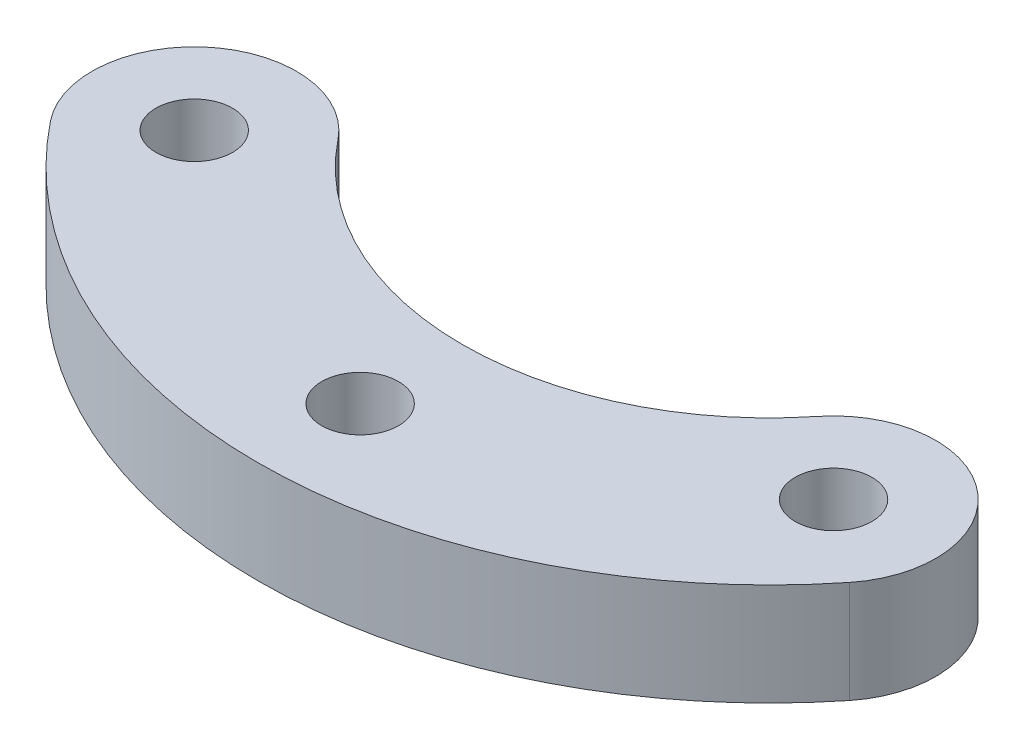
ISO-10303-21;
HEADER;
FILE_DESCRIPTION(('STEP AP214'),'2;1');
FILE_NAME('part.step','',(''),(''),'','','');
FILE_SCHEMA(('AUTOMOTIVE_DESIGN { 1 0 10303 214 1 1 1 1 }'));
ENDSEC;
DATA;
#1=APPLICATION_CONTEXT('core data for automotive mechanical design processes');
#2=APPLICATION_PROTOCOL_DEFINITION('international standard','automotive_design',2000,#1);
#3=PRODUCT_CONTEXT('',#1,'mechanical');
#4=PRODUCT('Part','Part','',(#3));
#5=PRODUCT_RELATED_PRODUCT_CATEGORY('part','',(#4));
#6=PRODUCT_DEFINITION_FORMATION('','',#4);
#7=PRODUCT_DEFINITION_CONTEXT('part definition',#1,'design');
#8=PRODUCT_DEFINITION('design','',#6,#7);
#9=PRODUCT_DEFINITION_SHAPE('','',#8);
#10=(LENGTH_UNIT() NAMED_UNIT(*) SI_UNIT(.MILLI.,.METRE.));
#11=(NAMED_UNIT(*) PLANE_ANGLE_UNIT() SI_UNIT($,.RADIAN.));
#12=(NAMED_UNIT(*) SI_UNIT($,.STERADIAN.) SOLID_ANGLE_UNIT());
#13=UNCERTAINTY_MEASURE_WITH_UNIT(LENGTH_MEASURE(1.E-05),#10,'distance_accuracy_value','');
#14=(GEOMETRIC_REPRESENTATION_CONTEXT(3) GLOBAL_UNCERTAINTY_ASSIGNED_CONTEXT((#13)) GLOBAL_UNIT_ASSIGNED_CONTEXT((#10,
#11,#12)) REPRESENTATION_CONTEXT('',''));
#15=CARTESIAN_POINT('',(0.,0.,0.));
#16=DIRECTION('',(0.,0.,1.));
#17=DIRECTION('',(1.,0.,0.));
#18=AXIS2_PLACEMENT_3D('',#15,#16,#17);
#19=CARTESIAN_POINT('',(-6.25,4.,4.99374608885954));
#20=DIRECTION('',(0.,-1.,0.));
#21=DIRECTION('',(0.,0.,-1.));
#22=AXIS2_PLACEMENT_3D('',#19,#20,#21);
#23=PLANE('',#22);
#24=CARTESIAN_POINT('',(-12.5,4.,9.98749217771909));
#25=DIRECTION('',(0.,1.,0.));
#26=DIRECTION('',(0.,0.,-1.));
#27=AXIS2_PLACEMENT_3D('',#24,#25,#26);
#28=CIRCLE('',#27,4.);
#29=CARTESIAN_POINT('',(-9.375,4.,7.49061913328931));
#30=VERTEX_POINT('',#29);
#31=CARTESIAN_POINT('',(-15.625,4.,12.4843652221489));
#32=VERTEX_POINT('',#31);
#33=EDGE_CURVE('E87',#30,#32,#28,.T.);
#34=ORIENTED_EDGE('',*,*,#33,.T.);
#35=CARTESIAN_POINT('',(0.,4.,0.));
#36=DIRECTION('',(0.,1.,0.));
#37=DIRECTION('',(0.,0.,1.));
#38=AXIS2_PLACEMENT_3D('',#35,#36,#37);
#39=CIRCLE('',#38,20.);
#40=CARTESIAN_POINT('',(15.625,4.,12.4843652221489));
#41=VERTEX_POINT('',#40);
#42=EDGE_CURVE('E82',#32,#41,#39,.T.);
#43=ORIENTED_EDGE('',*,*,#42,.T.);
#44=CARTESIAN_POINT('',(12.5,4.,9.98749217771909));
#45=DIRECTION('',(0.,1.,0.));
#46=DIRECTION('',(0.,0.,-1.));
#47=AXIS2_PLACEMENT_3D('',#44,#45,#46);
#48=CIRCLE('',#47,4.);
#49=CARTESIAN_POINT('',(9.375,4.,7.49061913328932));
#50=VERTEX_POINT('',#49);
#51=EDGE_CURVE('E85',#41,#50,#48,.T.);
#52=ORIENTED_EDGE('',*,*,#51,.T.);
#53=CARTESIAN_POINT('',(0.,4.,0.));
#54=DIRECTION('',(0.,-1.,0.));
#55=DIRECTION('',(0.,0.,1.));
#56=AXIS2_PLACEMENT_3D('',#53,#54,#55);
#57=CIRCLE('',#56,12.);
#58=EDGE_CURVE('E52',#50,#30,#57,.T.);
#59=ORIENTED_EDGE('',*,*,#58,.T.);
#60=EDGE_LOOP('',(#34,#43,#52,#59));
#61=FACE_BOUND('',#60,.T.);
#62=CARTESIAN_POINT('',(-12.5,4.,9.98749217771909));
#63=DIRECTION('',(0.,1.,0.));
#64=DIRECTION('',(0.,0.,1.));
#65=AXIS2_PLACEMENT_3D('',#62,#63,#64);
#66=CIRCLE('',#65,1.49999999999993);
#67=CARTESIAN_POINT('',(-12.5,4.,11.487492177719));
#68=VERTEX_POINT('',#67);
#69=EDGE_CURVE('E102',#68,#68,#66,.T.);
#70=ORIENTED_EDGE('',*,*,#69,.F.);
#71=EDGE_LOOP('',(#70));
#72=FACE_BOUND('',#71,.T.);
#73=CARTESIAN_POINT('',(12.5,4.,9.98749217771909));
#74=DIRECTION('',(0.,1.,0.));
#75=DIRECTION('',(0.,0.,1.));
#76=AXIS2_PLACEMENT_3D('',#73,#74,#75);
#77=CIRCLE('',#76,1.49999999999993);
#78=CARTESIAN_POINT('',(12.5,4.,11.487492177719));
#79=VERTEX_POINT('',#78);
#80=EDGE_CURVE('E117',#79,#79,#77,.T.);
#81=ORIENTED_EDGE('',*,*,#80,.F.);
#82=EDGE_LOOP('',(#81));
#83=FACE_BOUND('',#82,.T.);
#84=CARTESIAN_POINT('',(0.,4.,16.));
#85=DIRECTION('',(0.,1.,0.));
#86=DIRECTION('',(0.,0.,1.));
#87=AXIS2_PLACEMENT_3D('',#84,#85,#86);
#88=CIRCLE('',#87,1.5);
#89=CARTESIAN_POINT('',(0.,4.,17.5));
#90=VERTEX_POINT('',#89);
#91=EDGE_CURVE('E123',#90,#90,#88,.T.);
#92=ORIENTED_EDGE('',*,*,#91,.F.);
#93=EDGE_LOOP('',(#92));
#94=FACE_BOUND('',#93,.T.);
#95=ADVANCED_FACE('F35',(#61,#72,#83,#94),#23,.F.);
#96=CARTESIAN_POINT('',(-6.25,0.,4.99374608885954));
#97=DIRECTION('',(0.,-1.,0.));
#98=DIRECTION('',(0.,0.,-1.));
#99=AXIS2_PLACEMENT_3D('',#96,#97,#98);
#100=PLANE('',#99);
#101=CARTESIAN_POINT('',(12.5,0.,9.98749217771909));
#102=DIRECTION('',(0.,1.,0.));
#103=DIRECTION('',(0.,0.,1.));
#104=AXIS2_PLACEMENT_3D('',#101,#102,#103);
#105=CIRCLE('',#104,1.49999999999993);
#106=CARTESIAN_POINT('',(12.5,0.,11.487492177719));
#107=VERTEX_POINT('',#106);
#108=EDGE_CURVE('E120',#107,#107,#105,.T.);
#109=ORIENTED_EDGE('',*,*,#108,.T.);
#110=EDGE_LOOP('',(#109));
#111=FACE_BOUND('',#110,.T.);
#112=CARTESIAN_POINT('',(-12.5,0.,9.98749217771909));
#113=DIRECTION('',(0.,1.,0.));
#114=DIRECTION('',(0.,0.,-1.));
#115=AXIS2_PLACEMENT_3D('',#112,#113,#114);
#116=CIRCLE('',#115,4.);
#117=CARTESIAN_POINT('',(-9.375,0.,7.49061913328931));
#118=VERTEX_POINT('',#117);
#119=CARTESIAN_POINT('',(-15.625,0.,12.4843652221489));
#120=VERTEX_POINT('',#119);
#121=EDGE_CURVE('E99',#118,#120,#116,.T.);
#122=ORIENTED_EDGE('',*,*,#121,.F.);
#123=CARTESIAN_POINT('',(0.,0.,0.));
#124=DIRECTION('',(0.,-1.,0.));
#125=DIRECTION('',(0.,0.,1.));
#126=AXIS2_PLACEMENT_3D('',#123,#124,#125);
#127=CIRCLE('',#126,12.);
#128=CARTESIAN_POINT('',(9.375,0.,7.49061913328932));
#129=VERTEX_POINT('',#128);
#130=EDGE_CURVE('E75',#129,#118,#127,.T.);
#131=ORIENTED_EDGE('',*,*,#130,.F.);
#132=CARTESIAN_POINT('',(12.5,0.,9.98749217771909));
#133=DIRECTION('',(0.,1.,0.));
#134=DIRECTION('',(0.,0.,-1.));
#135=AXIS2_PLACEMENT_3D('',#132,#133,#134);
#136=CIRCLE('',#135,4.);
#137=CARTESIAN_POINT('',(15.625,0.,12.4843652221489));
#138=VERTEX_POINT('',#137);
#139=EDGE_CURVE('E69',#138,#129,#136,.T.);
#140=ORIENTED_EDGE('',*,*,#139,.F.);
#141=CARTESIAN_POINT('',(0.,0.,0.));
#142=DIRECTION('',(0.,1.,0.));
#143=DIRECTION('',(0.,0.,1.));
#144=AXIS2_PLACEMENT_3D('',#141,#142,#143);
#145=CIRCLE('',#144,20.);
#146=EDGE_CURVE('E91',#120,#138,#145,.T.);
#147=ORIENTED_EDGE('',*,*,#146,.F.);
#148=EDGE_LOOP('',(#122,#131,#140,#147));
#149=FACE_BOUND('',#148,.T.);
#150=CARTESIAN_POINT('',(-12.5,0.,9.98749217771909));
#151=DIRECTION('',(0.,1.,0.));
#152=DIRECTION('',(0.,0.,1.));
#153=AXIS2_PLACEMENT_3D('',#150,#151,#152);
#154=CIRCLE('',#153,1.49999999999993);
#155=CARTESIAN_POINT('',(-12.5,0.,11.487492177719));
#156=VERTEX_POINT('',#155);
#157=EDGE_CURVE('E114',#156,#156,#154,.T.);
#158=ORIENTED_EDGE('',*,*,#157,.T.);
#159=EDGE_LOOP('',(#158));
#160=FACE_BOUND('',#159,.T.);
#161=CARTESIAN_POINT('',(0.,0.,16.));
#162=DIRECTION('',(0.,1.,0.));
#163=DIRECTION('',(0.,0.,1.));
#164=AXIS2_PLACEMENT_3D('',#161,#162,#163);
#165=CIRCLE('',#164,1.5);
#166=CARTESIAN_POINT('',(0.,0.,17.5));
#167=VERTEX_POINT('',#166);
#168=EDGE_CURVE('E126',#167,#167,#165,.T.);
#169=ORIENTED_EDGE('',*,*,#168,.T.);
#170=EDGE_LOOP('',(#169));
#171=FACE_BOUND('',#170,.T.);
#172=ADVANCED_FACE('F110',(#111,#149,#160,#171),#100,.T.);
#173=CARTESIAN_POINT('',(-12.5,4.,9.98749217771909));
#174=DIRECTION('',(0.,-1.,0.));
#175=DIRECTION('',(0.,0.,-1.));
#176=AXIS2_PLACEMENT_3D('',#173,#174,#175);
#177=CYLINDRICAL_SURFACE('',#176,4.);
#178=ORIENTED_EDGE('',*,*,#121,.T.);
#179=DIRECTION('',(0.,-1.,0.));
#180=VECTOR('',#179,1.);
#181=CARTESIAN_POINT('',(-15.625,4.,12.4843652221489));
#182=LINE('',#181,#180);
#183=EDGE_CURVE('E11',#32,#120,#182,.T.);
#184=ORIENTED_EDGE('',*,*,#183,.F.);
#185=ORIENTED_EDGE('',*,*,#33,.F.);
#186=DIRECTION('',(0.,-1.,0.));
#187=VECTOR('',#186,1.);
#188=CARTESIAN_POINT('',(-9.375,4.,7.49061913328931));
#189=LINE('',#188,#187);
#190=EDGE_CURVE('E95',#30,#118,#189,.T.);
#191=ORIENTED_EDGE('',*,*,#190,.T.);
#192=EDGE_LOOP('',(#178,#184,#185,#191));
#193=FACE_BOUND('',#192,.T.);
#194=ADVANCED_FACE('F37',(#193),#177,.T.);
#195=CARTESIAN_POINT('',(0.,4.,0.));
#196=DIRECTION('',(0.,-1.,0.));
#197=DIRECTION('',(0.,0.,-1.));
#198=AXIS2_PLACEMENT_3D('',#195,#196,#197);
#199=CYLINDRICAL_SURFACE('',#198,20.);
#200=ORIENTED_EDGE('',*,*,#146,.T.);
#201=DIRECTION('',(0.,-1.,0.));
#202=VECTOR('',#201,1.);
#203=CARTESIAN_POINT('',(15.625,4.,12.4843652221489));
#204=LINE('',#203,#202);
#205=EDGE_CURVE('E44',#41,#138,#204,.T.);
#206=ORIENTED_EDGE('',*,*,#205,.F.);
#207=ORIENTED_EDGE('',*,*,#42,.F.);
#208=ORIENTED_EDGE('',*,*,#183,.T.);
#209=EDGE_LOOP('',(#200,#206,#207,#208));
#210=FACE_BOUND('',#209,.T.);
#211=ADVANCED_FACE('F90',(#210),#199,.T.);
#212=CARTESIAN_POINT('',(12.5,4.,9.98749217771909));
#213=DIRECTION('',(0.,-1.,0.));
#214=DIRECTION('',(0.,0.,-1.));
#215=AXIS2_PLACEMENT_3D('',#212,#213,#214);
#216=CYLINDRICAL_SURFACE('',#215,4.);
#217=ORIENTED_EDGE('',*,*,#139,.T.);
#218=DIRECTION('',(0.,-1.,0.));
#219=VECTOR('',#218,1.);
#220=CARTESIAN_POINT('',(9.375,4.,7.49061913328932));
#221=LINE('',#220,#219);
#222=EDGE_CURVE('E92',#50,#129,#221,.T.);
#223=ORIENTED_EDGE('',*,*,#222,.F.);
#224=ORIENTED_EDGE('',*,*,#51,.F.);
#225=ORIENTED_EDGE('',*,*,#205,.T.);
#226=EDGE_LOOP('',(#217,#223,#224,#225));
#227=FACE_BOUND('',#226,.T.);
#228=ADVANCED_FACE('F93',(#227),#216,.T.);
#229=CARTESIAN_POINT('',(0.,4.,0.));
#230=DIRECTION('',(0.,-1.,0.));
#231=DIRECTION('',(0.,0.,-1.));
#232=AXIS2_PLACEMENT_3D('',#229,#230,#231);
#233=CYLINDRICAL_SURFACE('',#232,12.);
#234=ORIENTED_EDGE('',*,*,#130,.T.);
#235=ORIENTED_EDGE('',*,*,#190,.F.);
#236=ORIENTED_EDGE('',*,*,#58,.F.);
#237=ORIENTED_EDGE('',*,*,#222,.T.);
#238=EDGE_LOOP('',(#234,#235,#236,#237));
#239=FACE_BOUND('',#238,.T.);
#240=ADVANCED_FACE('F107',(#239),#233,.F.);
#241=CARTESIAN_POINT('',(-12.5,4.,9.98749217771909));
#242=DIRECTION('',(0.,-1.,0.));
#243=DIRECTION('',(0.,0.,-1.));
#244=AXIS2_PLACEMENT_3D('',#241,#242,#243);
#245=CYLINDRICAL_SURFACE('',#244,1.49999999999993);
#246=ORIENTED_EDGE('',*,*,#69,.T.);
#247=EDGE_LOOP('',(#246));
#248=FACE_BOUND('',#247,.T.);
#249=ORIENTED_EDGE('',*,*,#157,.F.);
#250=EDGE_LOOP('',(#249));
#251=FACE_BOUND('',#250,.T.);
#252=ADVANCED_FACE('F143',(#248,#251),#245,.F.);
#253=CARTESIAN_POINT('',(12.5,4.,9.98749217771909));
#254=DIRECTION('',(0.,-1.,0.));
#255=DIRECTION('',(0.,0.,-1.));
#256=AXIS2_PLACEMENT_3D('',#253,#254,#255);
#257=CYLINDRICAL_SURFACE('',#256,1.49999999999993);
#258=ORIENTED_EDGE('',*,*,#80,.T.);
#259=EDGE_LOOP('',(#258));
#260=FACE_BOUND('',#259,.T.);
#261=ORIENTED_EDGE('',*,*,#108,.F.);
#262=EDGE_LOOP('',(#261));
#263=FACE_BOUND('',#262,.T.);
#264=ADVANCED_FACE('F189',(#260,#263),#257,.F.);
#265=CARTESIAN_POINT('',(0.,4.,16.));
#266=DIRECTION('',(0.,-1.,0.));
#267=DIRECTION('',(0.,0.,-1.));
#268=AXIS2_PLACEMENT_3D('',#265,#266,#267);
#269=CYLINDRICAL_SURFACE('',#268,1.5);
#270=ORIENTED_EDGE('',*,*,#91,.T.);
#271=EDGE_LOOP('',(#270));
#272=FACE_BOUND('',#271,.T.);
#273=ORIENTED_EDGE('',*,*,#168,.F.);
#274=EDGE_LOOP('',(#273));
#275=FACE_BOUND('',#274,.T.);
#276=ADVANCED_FACE('F132',(#272,#275),#269,.F.);
#277=CLOSED_SHELL('',(#95,#172,#194,#211,#228,#240,#252,#264,#276));
#278=MANIFOLD_SOLID_BREP('B2',#277);
#279=ADVANCED_BREP_SHAPE_REPRESENTATION('',(#18,#278),#14);
#280=SHAPE_DEFINITION_REPRESENTATION(#9,#279);
ENDSEC;
END-ISO-10303-21;
